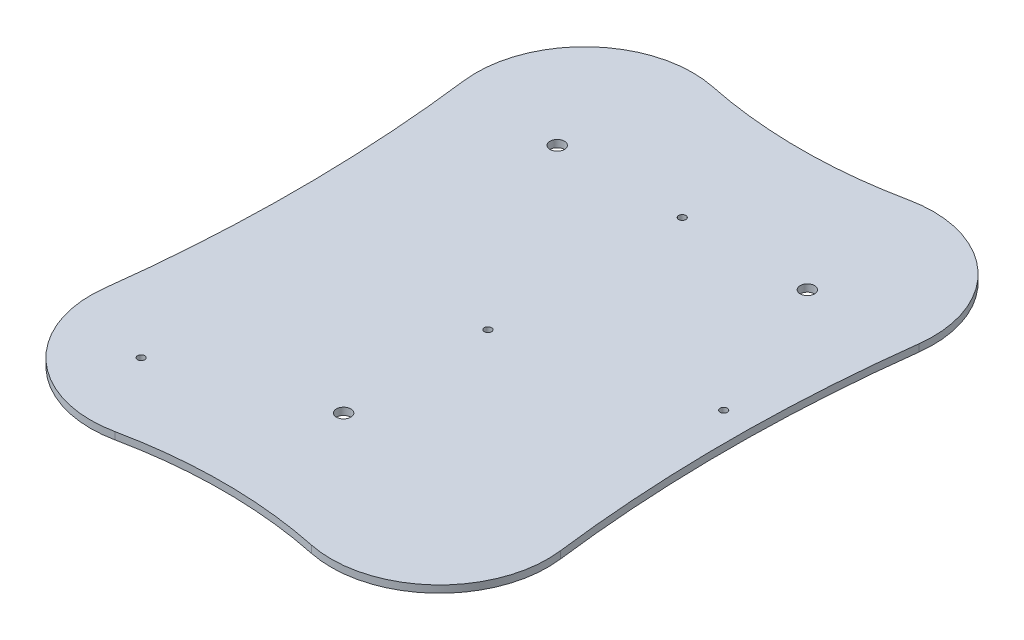
ISO-10303-21;
HEADER;
FILE_DESCRIPTION(('STEP AP214'),'2;1');
FILE_NAME('part.step','',(''),(''),'','','');
FILE_SCHEMA(('AUTOMOTIVE_DESIGN { 1 0 10303 214 1 1 1 1 }'));
ENDSEC;
DATA;
#1=APPLICATION_CONTEXT('core data for automotive mechanical design processes');
#2=APPLICATION_PROTOCOL_DEFINITION('international standard','automotive_design',2000,#1);
#3=PRODUCT_CONTEXT('',#1,'mechanical');
#4=PRODUCT('Part','Part','',(#3));
#5=PRODUCT_RELATED_PRODUCT_CATEGORY('part','',(#4));
#6=PRODUCT_DEFINITION_FORMATION('','',#4);
#7=PRODUCT_DEFINITION_CONTEXT('part definition',#1,'design');
#8=PRODUCT_DEFINITION('design','',#6,#7);
#9=PRODUCT_DEFINITION_SHAPE('','',#8);
#10=(LENGTH_UNIT() NAMED_UNIT(*) SI_UNIT(.MILLI.,.METRE.));
#11=(NAMED_UNIT(*) PLANE_ANGLE_UNIT() SI_UNIT($,.RADIAN.));
#12=(NAMED_UNIT(*) SI_UNIT($,.STERADIAN.) SOLID_ANGLE_UNIT());
#13=UNCERTAINTY_MEASURE_WITH_UNIT(LENGTH_MEASURE(1.E-05),#10,'distance_accuracy_value','');
#14=(GEOMETRIC_REPRESENTATION_CONTEXT(3) GLOBAL_UNCERTAINTY_ASSIGNED_CONTEXT((#13)) GLOBAL_UNIT_ASSIGNED_CONTEXT((#10,
#11,#12)) REPRESENTATION_CONTEXT('',''));
#15=CARTESIAN_POINT('',(0.,0.,0.));
#16=DIRECTION('',(0.,0.,1.));
#17=DIRECTION('',(1.,0.,0.));
#18=AXIS2_PLACEMENT_3D('',#15,#16,#17);
#19=CARTESIAN_POINT('',(-185.000006532533,1.5,25.0390765857744));
#20=DIRECTION('',(0.,-1.,0.));
#21=DIRECTION('',(0.,0.,-1.));
#22=AXIS2_PLACEMENT_3D('',#19,#20,#21);
#23=PLANE('',#22);
#24=CARTESIAN_POINT('',(38.9999999999999,1.5,0.));
#25=DIRECTION('',(0.,1.,0.));
#26=DIRECTION('',(0.,0.,1.));
#27=AXIS2_PLACEMENT_3D('',#24,#25,#26);
#28=CIRCLE('',#27,0.749999999999999);
#29=CARTESIAN_POINT('',(38.9999999999999,1.5,0.749999999999999));
#30=VERTEX_POINT('',#29);
#31=EDGE_CURVE('E214',#30,#30,#28,.T.);
#32=ORIENTED_EDGE('',*,*,#31,.F.);
#33=EDGE_LOOP('',(#32));
#34=FACE_BOUND('',#33,.T.);
#35=CARTESIAN_POINT('',(-31.0104207051516,1.5,51.0885608116344));
#36=DIRECTION('',(0.,1.,0.));
#37=DIRECTION('',(0.,0.,1.));
#38=AXIS2_PLACEMENT_3D('',#35,#36,#37);
#39=CIRCLE('',#38,0.750000000000007);
#40=CARTESIAN_POINT('',(-31.0104207051516,1.5,51.8385608116344));
#41=VERTEX_POINT('',#40);
#42=EDGE_CURVE('E208',#41,#41,#39,.T.);
#43=ORIENTED_EDGE('',*,*,#42,.F.);
#44=EDGE_LOOP('',(#43));
#45=FACE_BOUND('',#44,.T.);
#46=CARTESIAN_POINT('',(0.,1.5,10.));
#47=DIRECTION('',(0.,1.,0.));
#48=DIRECTION('',(0.,0.,1.));
#49=AXIS2_PLACEMENT_3D('',#46,#47,#48);
#50=CIRCLE('',#49,0.75);
#51=CARTESIAN_POINT('',(0.,1.5,10.75));
#52=VERTEX_POINT('',#51);
#53=EDGE_CURVE('E202',#52,#52,#50,.T.);
#54=ORIENTED_EDGE('',*,*,#53,.F.);
#55=EDGE_LOOP('',(#54));
#56=FACE_BOUND('',#55,.T.);
#57=CARTESIAN_POINT('',(0.,1.5,-30.3973683071413));
#58=DIRECTION('',(0.,1.,0.));
#59=DIRECTION('',(0.,0.,1.));
#60=AXIS2_PLACEMENT_3D('',#57,#58,#59);
#61=CIRCLE('',#60,0.75);
#62=CARTESIAN_POINT('',(0.,1.5,-29.6473683071413));
#63=VERTEX_POINT('',#62);
#64=EDGE_CURVE('E196',#63,#63,#61,.T.);
#65=ORIENTED_EDGE('',*,*,#64,.F.);
#66=EDGE_LOOP('',(#65));
#67=FACE_BOUND('',#66,.T.);
#68=CARTESIAN_POINT('',(26.,1.5,-30.3973683071413));
#69=DIRECTION('',(0.,1.,0.));
#70=DIRECTION('',(0.,0.,1.));
#71=AXIS2_PLACEMENT_3D('',#68,#69,#70);
#72=CIRCLE('',#71,1.5);
#73=CARTESIAN_POINT('',(26.,1.5,-28.8973683071413));
#74=VERTEX_POINT('',#73);
#75=EDGE_CURVE('E181',#74,#74,#72,.T.);
#76=ORIENTED_EDGE('',*,*,#75,.F.);
#77=EDGE_LOOP('',(#76));
#78=FACE_BOUND('',#77,.T.);
#79=CARTESIAN_POINT('',(-25.000013065066,1.5,45.0781531715487));
#80=DIRECTION('',(0.,1.,0.));
#81=DIRECTION('',(0.,0.,-1.));
#82=AXIS2_PLACEMENT_3D('',#79,#80,#81);
#83=CIRCLE('',#82,22.5);
#84=CARTESIAN_POINT('',(-47.3255935488986,1.5,42.2820029502779));
#85=VERTEX_POINT('',#84);
#86=CARTESIAN_POINT('',(-20.4081739306661,1.5,67.1046148339173));
#87=VERTEX_POINT('',#86);
#88=EDGE_CURVE('E144',#85,#87,#83,.T.);
#89=ORIENTED_EDGE('',*,*,#88,.T.);
#90=CARTESIAN_POINT('',(0.,1.5,165.));
#91=DIRECTION('',(0.,-1.,0.));
#92=DIRECTION('',(0.,0.,-1.));
#93=AXIS2_PLACEMENT_3D('',#90,#91,#92);
#94=CIRCLE('',#93,100.);
#95=CARTESIAN_POINT('',(20.4081739306661,1.5,67.1046148339173));
#96=VERTEX_POINT('',#95);
#97=EDGE_CURVE('E92',#87,#96,#94,.T.);
#98=ORIENTED_EDGE('',*,*,#97,.T.);
#99=CARTESIAN_POINT('',(25.000013065066,1.5,45.0781531715487));
#100=DIRECTION('',(0.,1.,0.));
#101=DIRECTION('',(0.,0.,1.));
#102=AXIS2_PLACEMENT_3D('',#99,#100,#101);
#103=CIRCLE('',#102,22.5);
#104=CARTESIAN_POINT('',(47.3255935488986,1.5,42.2820029502779));
#105=VERTEX_POINT('',#104);
#106=EDGE_CURVE('E159',#96,#105,#103,.T.);
#107=ORIENTED_EDGE('',*,*,#106,.T.);
#108=CARTESIAN_POINT('',(345.,1.5,5.));
#109=DIRECTION('',(0.,-1.,0.));
#110=DIRECTION('',(0.,0.,1.));
#111=AXIS2_PLACEMENT_3D('',#108,#109,#110);
#112=CIRCLE('',#111,300.);
#113=CARTESIAN_POINT('',(47.3255935488986,1.5,-32.2820029502779));
#114=VERTEX_POINT('',#113);
#115=EDGE_CURVE('E172',#105,#114,#112,.T.);
#116=ORIENTED_EDGE('',*,*,#115,.T.);
#117=CARTESIAN_POINT('',(25.000013065066,1.5,-35.0781531715487));
#118=DIRECTION('',(0.,1.,0.));
#119=DIRECTION('',(0.,0.,-1.));
#120=AXIS2_PLACEMENT_3D('',#117,#118,#119);
#121=CIRCLE('',#120,22.5);
#122=CARTESIAN_POINT('',(20.4081739306661,1.5,-57.1046148339173));
#123=VERTEX_POINT('',#122);
#124=EDGE_CURVE('E111',#114,#123,#121,.T.);
#125=ORIENTED_EDGE('',*,*,#124,.T.);
#126=CARTESIAN_POINT('',(0.,1.5,-155.));
#127=DIRECTION('',(0.,-1.,0.));
#128=DIRECTION('',(0.,0.,1.));
#129=AXIS2_PLACEMENT_3D('',#126,#127,#128);
#130=CIRCLE('',#129,100.);
#131=CARTESIAN_POINT('',(-20.4081739306661,1.5,-57.1046148339173));
#132=VERTEX_POINT('',#131);
#133=EDGE_CURVE('E105',#123,#132,#130,.T.);
#134=ORIENTED_EDGE('',*,*,#133,.T.);
#135=CARTESIAN_POINT('',(-25.000013065066,1.5,-35.0781531715487));
#136=DIRECTION('',(0.,1.,0.));
#137=DIRECTION('',(0.,0.,1.));
#138=AXIS2_PLACEMENT_3D('',#135,#136,#137);
#139=CIRCLE('',#138,22.5);
#140=CARTESIAN_POINT('',(-47.3255935488986,1.5,-32.2820029502779));
#141=VERTEX_POINT('',#140);
#142=EDGE_CURVE('E109',#132,#141,#139,.T.);
#143=ORIENTED_EDGE('',*,*,#142,.T.);
#144=CARTESIAN_POINT('',(-345.,1.5,5.));
#145=DIRECTION('',(0.,-1.,0.));
#146=DIRECTION('',(0.,0.,-1.));
#147=AXIS2_PLACEMENT_3D('',#144,#145,#146);
#148=CIRCLE('',#147,300.);
#149=EDGE_CURVE('E49',#141,#85,#148,.T.);
#150=ORIENTED_EDGE('',*,*,#149,.T.);
#151=EDGE_LOOP('',(#89,#98,#107,#116,#125,#134,#143,#150));
#152=FACE_BOUND('',#151,.T.);
#153=CARTESIAN_POINT('',(-26.,1.5,-30.3973683071413));
#154=DIRECTION('',(0.,1.,0.));
#155=DIRECTION('',(0.,0.,1.));
#156=AXIS2_PLACEMENT_3D('',#153,#154,#155);
#157=CIRCLE('',#156,1.5);
#158=CARTESIAN_POINT('',(-26.,1.5,-28.8973683071413));
#159=VERTEX_POINT('',#158);
#160=EDGE_CURVE('E133',#159,#159,#157,.T.);
#161=ORIENTED_EDGE('',*,*,#160,.F.);
#162=EDGE_LOOP('',(#161));
#163=FACE_BOUND('',#162,.T.);
#164=CARTESIAN_POINT('',(0.,1.5,40.));
#165=DIRECTION('',(0.,1.,0.));
#166=DIRECTION('',(0.,0.,1.));
#167=AXIS2_PLACEMENT_3D('',#164,#165,#166);
#168=CIRCLE('',#167,1.5);
#169=CARTESIAN_POINT('',(0.,1.5,41.5));
#170=VERTEX_POINT('',#169);
#171=EDGE_CURVE('E187',#170,#170,#168,.T.);
#172=ORIENTED_EDGE('',*,*,#171,.F.);
#173=EDGE_LOOP('',(#172));
#174=FACE_BOUND('',#173,.T.);
#175=ADVANCED_FACE('F32',(#34,#45,#56,#67,#78,#152,#163,#174),#23,.F.);
#176=CARTESIAN_POINT('',(-185.000006532533,0.,25.0390765857744));
#177=DIRECTION('',(0.,-1.,0.));
#178=DIRECTION('',(0.,0.,-1.));
#179=AXIS2_PLACEMENT_3D('',#176,#177,#178);
#180=PLANE('',#179);
#181=CARTESIAN_POINT('',(38.9999999999999,0.,0.));
#182=DIRECTION('',(0.,1.,0.));
#183=DIRECTION('',(0.,0.,1.));
#184=AXIS2_PLACEMENT_3D('',#181,#182,#183);
#185=CIRCLE('',#184,0.749999999999999);
#186=CARTESIAN_POINT('',(38.9999999999999,0.,0.749999999999999));
#187=VERTEX_POINT('',#186);
#188=EDGE_CURVE('E211',#187,#187,#185,.T.);
#189=ORIENTED_EDGE('',*,*,#188,.T.);
#190=EDGE_LOOP('',(#189));
#191=FACE_BOUND('',#190,.T.);
#192=CARTESIAN_POINT('',(-31.0104207051516,0.,51.0885608116344));
#193=DIRECTION('',(0.,1.,0.));
#194=DIRECTION('',(0.,0.,1.));
#195=AXIS2_PLACEMENT_3D('',#192,#193,#194);
#196=CIRCLE('',#195,0.750000000000007);
#197=CARTESIAN_POINT('',(-31.0104207051516,0.,51.8385608116344));
#198=VERTEX_POINT('',#197);
#199=EDGE_CURVE('E205',#198,#198,#196,.T.);
#200=ORIENTED_EDGE('',*,*,#199,.T.);
#201=EDGE_LOOP('',(#200));
#202=FACE_BOUND('',#201,.T.);
#203=CARTESIAN_POINT('',(0.,0.,10.));
#204=DIRECTION('',(0.,1.,0.));
#205=DIRECTION('',(0.,0.,1.));
#206=AXIS2_PLACEMENT_3D('',#203,#204,#205);
#207=CIRCLE('',#206,0.75);
#208=CARTESIAN_POINT('',(0.,0.,10.75));
#209=VERTEX_POINT('',#208);
#210=EDGE_CURVE('E199',#209,#209,#207,.T.);
#211=ORIENTED_EDGE('',*,*,#210,.T.);
#212=EDGE_LOOP('',(#211));
#213=FACE_BOUND('',#212,.T.);
#214=CARTESIAN_POINT('',(0.,0.,-30.3973683071413));
#215=DIRECTION('',(0.,1.,0.));
#216=DIRECTION('',(0.,0.,1.));
#217=AXIS2_PLACEMENT_3D('',#214,#215,#216);
#218=CIRCLE('',#217,0.75);
#219=CARTESIAN_POINT('',(0.,0.,-29.6473683071413));
#220=VERTEX_POINT('',#219);
#221=EDGE_CURVE('E193',#220,#220,#218,.T.);
#222=ORIENTED_EDGE('',*,*,#221,.T.);
#223=EDGE_LOOP('',(#222));
#224=FACE_BOUND('',#223,.T.);
#225=CARTESIAN_POINT('',(26.,0.,-30.3973683071413));
#226=DIRECTION('',(0.,1.,0.));
#227=DIRECTION('',(0.,0.,1.));
#228=AXIS2_PLACEMENT_3D('',#225,#226,#227);
#229=CIRCLE('',#228,1.5);
#230=CARTESIAN_POINT('',(26.,0.,-28.8973683071413));
#231=VERTEX_POINT('',#230);
#232=EDGE_CURVE('E184',#231,#231,#229,.T.);
#233=ORIENTED_EDGE('',*,*,#232,.T.);
#234=EDGE_LOOP('',(#233));
#235=FACE_BOUND('',#234,.T.);
#236=CARTESIAN_POINT('',(-25.000013065066,0.,45.0781531715487));
#237=DIRECTION('',(0.,1.,0.));
#238=DIRECTION('',(0.,0.,-1.));
#239=AXIS2_PLACEMENT_3D('',#236,#237,#238);
#240=CIRCLE('',#239,22.5);
#241=CARTESIAN_POINT('',(-47.3255935488986,0.,42.2820029502779));
#242=VERTEX_POINT('',#241);
#243=CARTESIAN_POINT('',(-20.4081739306661,0.,67.1046148339173));
#244=VERTEX_POINT('',#243);
#245=EDGE_CURVE('E129',#242,#244,#240,.T.);
#246=ORIENTED_EDGE('',*,*,#245,.F.);
#247=CARTESIAN_POINT('',(-345.,0.,5.));
#248=DIRECTION('',(0.,-1.,0.));
#249=DIRECTION('',(0.,0.,-1.));
#250=AXIS2_PLACEMENT_3D('',#247,#248,#249);
#251=CIRCLE('',#250,300.);
#252=CARTESIAN_POINT('',(-47.3255935488986,0.,-32.2820029502779));
#253=VERTEX_POINT('',#252);
#254=EDGE_CURVE('E84',#253,#242,#251,.T.);
#255=ORIENTED_EDGE('',*,*,#254,.F.);
#256=CARTESIAN_POINT('',(-25.000013065066,0.,-35.0781531715487));
#257=DIRECTION('',(0.,1.,0.));
#258=DIRECTION('',(0.,0.,1.));
#259=AXIS2_PLACEMENT_3D('',#256,#257,#258);
#260=CIRCLE('',#259,22.5);
#261=CARTESIAN_POINT('',(-20.4081739306661,0.,-57.1046148339173));
#262=VERTEX_POINT('',#261);
#263=EDGE_CURVE('E78',#262,#253,#260,.T.);
#264=ORIENTED_EDGE('',*,*,#263,.F.);
#265=CARTESIAN_POINT('',(0.,0.,-155.));
#266=DIRECTION('',(0.,-1.,0.));
#267=DIRECTION('',(0.,0.,1.));
#268=AXIS2_PLACEMENT_3D('',#265,#266,#267);
#269=CIRCLE('',#268,100.);
#270=CARTESIAN_POINT('',(20.4081739306661,0.,-57.1046148339173));
#271=VERTEX_POINT('',#270);
#272=EDGE_CURVE('E119',#271,#262,#269,.T.);
#273=ORIENTED_EDGE('',*,*,#272,.F.);
#274=CARTESIAN_POINT('',(25.000013065066,0.,-35.0781531715487));
#275=DIRECTION('',(0.,1.,0.));
#276=DIRECTION('',(0.,0.,-1.));
#277=AXIS2_PLACEMENT_3D('',#274,#275,#276);
#278=CIRCLE('',#277,22.5);
#279=CARTESIAN_POINT('',(47.3255935488986,0.,-32.2820029502779));
#280=VERTEX_POINT('',#279);
#281=EDGE_CURVE('E139',#280,#271,#278,.T.);
#282=ORIENTED_EDGE('',*,*,#281,.F.);
#283=CARTESIAN_POINT('',(345.,0.,5.));
#284=DIRECTION('',(0.,-1.,0.));
#285=DIRECTION('',(0.,0.,1.));
#286=AXIS2_PLACEMENT_3D('',#283,#284,#285);
#287=CIRCLE('',#286,300.);
#288=CARTESIAN_POINT('',(47.3255935488986,0.,42.2820029502779));
#289=VERTEX_POINT('',#288);
#290=EDGE_CURVE('E137',#289,#280,#287,.T.);
#291=ORIENTED_EDGE('',*,*,#290,.F.);
#292=CARTESIAN_POINT('',(25.000013065066,0.,45.0781531715487));
#293=DIRECTION('',(0.,1.,0.));
#294=DIRECTION('',(0.,0.,1.));
#295=AXIS2_PLACEMENT_3D('',#292,#293,#294);
#296=CIRCLE('',#295,22.5);
#297=CARTESIAN_POINT('',(20.4081739306661,0.,67.1046148339173));
#298=VERTEX_POINT('',#297);
#299=EDGE_CURVE('E135',#298,#289,#296,.T.);
#300=ORIENTED_EDGE('',*,*,#299,.F.);
#301=CARTESIAN_POINT('',(0.,0.,165.));
#302=DIRECTION('',(0.,-1.,0.));
#303=DIRECTION('',(0.,0.,-1.));
#304=AXIS2_PLACEMENT_3D('',#301,#302,#303);
#305=CIRCLE('',#304,100.);
#306=EDGE_CURVE('E132',#244,#298,#305,.T.);
#307=ORIENTED_EDGE('',*,*,#306,.F.);
#308=EDGE_LOOP('',(#246,#255,#264,#273,#282,#291,#300,#307));
#309=FACE_BOUND('',#308,.T.);
#310=CARTESIAN_POINT('',(-26.,0.,-30.3973683071413));
#311=DIRECTION('',(0.,1.,0.));
#312=DIRECTION('',(0.,0.,1.));
#313=AXIS2_PLACEMENT_3D('',#310,#311,#312);
#314=CIRCLE('',#313,1.5);
#315=CARTESIAN_POINT('',(-26.,0.,-28.8973683071413));
#316=VERTEX_POINT('',#315);
#317=EDGE_CURVE('E178',#316,#316,#314,.T.);
#318=ORIENTED_EDGE('',*,*,#317,.T.);
#319=EDGE_LOOP('',(#318));
#320=FACE_BOUND('',#319,.T.);
#321=CARTESIAN_POINT('',(0.,0.,40.));
#322=DIRECTION('',(0.,1.,0.));
#323=DIRECTION('',(0.,0.,1.));
#324=AXIS2_PLACEMENT_3D('',#321,#322,#323);
#325=CIRCLE('',#324,1.5);
#326=CARTESIAN_POINT('',(0.,0.,41.5));
#327=VERTEX_POINT('',#326);
#328=EDGE_CURVE('E190',#327,#327,#325,.T.);
#329=ORIENTED_EDGE('',*,*,#328,.T.);
#330=EDGE_LOOP('',(#329));
#331=FACE_BOUND('',#330,.T.);
#332=ADVANCED_FACE('F163',(#191,#202,#213,#224,#235,#309,#320,#331),#180,.T.);
#333=CARTESIAN_POINT('',(-25.000013065066,1.5,45.0781531715487));
#334=DIRECTION('',(0.,-1.,0.));
#335=DIRECTION('',(0.,0.,-1.));
#336=AXIS2_PLACEMENT_3D('',#333,#334,#335);
#337=CYLINDRICAL_SURFACE('',#336,22.5);
#338=ORIENTED_EDGE('',*,*,#245,.T.);
#339=DIRECTION('',(0.,-1.,0.));
#340=VECTOR('',#339,1.);
#341=CARTESIAN_POINT('',(-20.4081739306661,1.5,67.1046148339173));
#342=LINE('',#341,#340);
#343=EDGE_CURVE('E11',#87,#244,#342,.T.);
#344=ORIENTED_EDGE('',*,*,#343,.F.);
#345=ORIENTED_EDGE('',*,*,#88,.F.);
#346=DIRECTION('',(0.,-1.,0.));
#347=VECTOR('',#346,1.);
#348=CARTESIAN_POINT('',(-47.3255935488986,1.5,42.2820029502779));
#349=LINE('',#348,#347);
#350=EDGE_CURVE('E125',#85,#242,#349,.T.);
#351=ORIENTED_EDGE('',*,*,#350,.T.);
#352=EDGE_LOOP('',(#338,#344,#345,#351));
#353=FACE_BOUND('',#352,.T.);
#354=ADVANCED_FACE('F34',(#353),#337,.T.);
#355=CARTESIAN_POINT('',(0.,1.5,165.));
#356=DIRECTION('',(0.,-1.,0.));
#357=DIRECTION('',(0.,0.,-1.));
#358=AXIS2_PLACEMENT_3D('',#355,#356,#357);
#359=CYLINDRICAL_SURFACE('',#358,100.);
#360=ORIENTED_EDGE('',*,*,#306,.T.);
#361=DIRECTION('',(0.,-1.,0.));
#362=VECTOR('',#361,1.);
#363=CARTESIAN_POINT('',(20.4081739306661,1.5,67.1046148339173));
#364=LINE('',#363,#362);
#365=EDGE_CURVE('E41',#96,#298,#364,.T.);
#366=ORIENTED_EDGE('',*,*,#365,.F.);
#367=ORIENTED_EDGE('',*,*,#97,.F.);
#368=ORIENTED_EDGE('',*,*,#343,.T.);
#369=EDGE_LOOP('',(#360,#366,#367,#368));
#370=FACE_BOUND('',#369,.T.);
#371=ADVANCED_FACE('F253',(#370),#359,.F.);
#372=CARTESIAN_POINT('',(25.000013065066,1.5,45.0781531715487));
#373=DIRECTION('',(0.,-1.,0.));
#374=DIRECTION('',(0.,0.,-1.));
#375=AXIS2_PLACEMENT_3D('',#372,#373,#374);
#376=CYLINDRICAL_SURFACE('',#375,22.5);
#377=ORIENTED_EDGE('',*,*,#299,.T.);
#378=DIRECTION('',(0.,-1.,0.));
#379=VECTOR('',#378,1.);
#380=CARTESIAN_POINT('',(47.3255935488986,1.5,42.2820029502779));
#381=LINE('',#380,#379);
#382=EDGE_CURVE('E151',#105,#289,#381,.T.);
#383=ORIENTED_EDGE('',*,*,#382,.F.);
#384=ORIENTED_EDGE('',*,*,#106,.F.);
#385=ORIENTED_EDGE('',*,*,#365,.T.);
#386=EDGE_LOOP('',(#377,#383,#384,#385));
#387=FACE_BOUND('',#386,.T.);
#388=ADVANCED_FACE('F157',(#387),#376,.T.);
#389=CARTESIAN_POINT('',(345.,1.5,5.));
#390=DIRECTION('',(0.,-1.,0.));
#391=DIRECTION('',(0.,0.,-1.));
#392=AXIS2_PLACEMENT_3D('',#389,#390,#391);
#393=CYLINDRICAL_SURFACE('',#392,300.);
#394=ORIENTED_EDGE('',*,*,#290,.T.);
#395=DIRECTION('',(0.,-1.,0.));
#396=VECTOR('',#395,1.);
#397=CARTESIAN_POINT('',(47.3255935488986,1.5,-32.2820029502779));
#398=LINE('',#397,#396);
#399=EDGE_CURVE('E148',#114,#280,#398,.T.);
#400=ORIENTED_EDGE('',*,*,#399,.F.);
#401=ORIENTED_EDGE('',*,*,#115,.F.);
#402=ORIENTED_EDGE('',*,*,#382,.T.);
#403=EDGE_LOOP('',(#394,#400,#401,#402));
#404=FACE_BOUND('',#403,.T.);
#405=ADVANCED_FACE('F168',(#404),#393,.F.);
#406=CARTESIAN_POINT('',(25.000013065066,1.5,-35.0781531715487));
#407=DIRECTION('',(0.,-1.,0.));
#408=DIRECTION('',(0.,0.,-1.));
#409=AXIS2_PLACEMENT_3D('',#406,#407,#408);
#410=CYLINDRICAL_SURFACE('',#409,22.5);
#411=ORIENTED_EDGE('',*,*,#281,.T.);
#412=DIRECTION('',(0.,-1.,0.));
#413=VECTOR('',#412,1.);
#414=CARTESIAN_POINT('',(20.4081739306661,1.5,-57.1046148339173));
#415=LINE('',#414,#413);
#416=EDGE_CURVE('E120',#123,#271,#415,.T.);
#417=ORIENTED_EDGE('',*,*,#416,.F.);
#418=ORIENTED_EDGE('',*,*,#124,.F.);
#419=ORIENTED_EDGE('',*,*,#399,.T.);
#420=EDGE_LOOP('',(#411,#417,#418,#419));
#421=FACE_BOUND('',#420,.T.);
#422=ADVANCED_FACE('F171',(#421),#410,.T.);
#423=CARTESIAN_POINT('',(0.,1.5,-155.));
#424=DIRECTION('',(0.,-1.,0.));
#425=DIRECTION('',(0.,0.,-1.));
#426=AXIS2_PLACEMENT_3D('',#423,#424,#425);
#427=CYLINDRICAL_SURFACE('',#426,100.);
#428=ORIENTED_EDGE('',*,*,#272,.T.);
#429=DIRECTION('',(0.,-1.,0.));
#430=VECTOR('',#429,1.);
#431=CARTESIAN_POINT('',(-20.4081739306661,1.5,-57.1046148339173));
#432=LINE('',#431,#430);
#433=EDGE_CURVE('E116',#132,#262,#432,.T.);
#434=ORIENTED_EDGE('',*,*,#433,.F.);
#435=ORIENTED_EDGE('',*,*,#133,.F.);
#436=ORIENTED_EDGE('',*,*,#416,.T.);
#437=EDGE_LOOP('',(#428,#434,#435,#436));
#438=FACE_BOUND('',#437,.T.);
#439=ADVANCED_FACE('F117',(#438),#427,.F.);
#440=CARTESIAN_POINT('',(-25.000013065066,1.5,-35.0781531715487));
#441=DIRECTION('',(0.,-1.,0.));
#442=DIRECTION('',(0.,0.,-1.));
#443=AXIS2_PLACEMENT_3D('',#440,#441,#442);
#444=CYLINDRICAL_SURFACE('',#443,22.5);
#445=ORIENTED_EDGE('',*,*,#263,.T.);
#446=DIRECTION('',(0.,-1.,0.));
#447=VECTOR('',#446,1.);
#448=CARTESIAN_POINT('',(-47.3255935488986,1.5,-32.2820029502779));
#449=LINE('',#448,#447);
#450=EDGE_CURVE('E121',#141,#253,#449,.T.);
#451=ORIENTED_EDGE('',*,*,#450,.F.);
#452=ORIENTED_EDGE('',*,*,#142,.F.);
#453=ORIENTED_EDGE('',*,*,#433,.T.);
#454=EDGE_LOOP('',(#445,#451,#452,#453));
#455=FACE_BOUND('',#454,.T.);
#456=ADVANCED_FACE('F123',(#455),#444,.T.);
#457=CARTESIAN_POINT('',(-345.,1.5,5.));
#458=DIRECTION('',(0.,-1.,0.));
#459=DIRECTION('',(0.,0.,-1.));
#460=AXIS2_PLACEMENT_3D('',#457,#458,#459);
#461=CYLINDRICAL_SURFACE('',#460,300.);
#462=ORIENTED_EDGE('',*,*,#254,.T.);
#463=ORIENTED_EDGE('',*,*,#350,.F.);
#464=ORIENTED_EDGE('',*,*,#149,.F.);
#465=ORIENTED_EDGE('',*,*,#450,.T.);
#466=EDGE_LOOP('',(#462,#463,#464,#465));
#467=FACE_BOUND('',#466,.T.);
#468=ADVANCED_FACE('F257',(#467),#461,.F.);
#469=CARTESIAN_POINT('',(-26.,1.5,-30.3973683071413));
#470=DIRECTION('',(0.,-1.,0.));
#471=DIRECTION('',(0.,0.,-1.));
#472=AXIS2_PLACEMENT_3D('',#469,#470,#471);
#473=CYLINDRICAL_SURFACE('',#472,1.5);
#474=ORIENTED_EDGE('',*,*,#160,.T.);
#475=EDGE_LOOP('',(#474));
#476=FACE_BOUND('',#475,.T.);
#477=ORIENTED_EDGE('',*,*,#317,.F.);
#478=EDGE_LOOP('',(#477));
#479=FACE_BOUND('',#478,.T.);
#480=ADVANCED_FACE('F244',(#476,#479),#473,.F.);
#481=CARTESIAN_POINT('',(26.,1.5,-30.3973683071413));
#482=DIRECTION('',(0.,-1.,0.));
#483=DIRECTION('',(0.,0.,-1.));
#484=AXIS2_PLACEMENT_3D('',#481,#482,#483);
#485=CYLINDRICAL_SURFACE('',#484,1.5);
#486=ORIENTED_EDGE('',*,*,#75,.T.);
#487=EDGE_LOOP('',(#486));
#488=FACE_BOUND('',#487,.T.);
#489=ORIENTED_EDGE('',*,*,#232,.F.);
#490=EDGE_LOOP('',(#489));
#491=FACE_BOUND('',#490,.T.);
#492=ADVANCED_FACE('F240',(#488,#491),#485,.F.);
#493=CARTESIAN_POINT('',(0.,1.5,40.));
#494=DIRECTION('',(0.,-1.,0.));
#495=DIRECTION('',(0.,0.,-1.));
#496=AXIS2_PLACEMENT_3D('',#493,#494,#495);
#497=CYLINDRICAL_SURFACE('',#496,1.5);
#498=ORIENTED_EDGE('',*,*,#171,.T.);
#499=EDGE_LOOP('',(#498));
#500=FACE_BOUND('',#499,.T.);
#501=ORIENTED_EDGE('',*,*,#328,.F.);
#502=EDGE_LOOP('',(#501));
#503=FACE_BOUND('',#502,.T.);
#504=ADVANCED_FACE('F243',(#500,#503),#497,.F.);
#505=CARTESIAN_POINT('',(0.,0.,-30.3973683071413));
#506=DIRECTION('',(0.,1.,0.));
#507=DIRECTION('',(0.,0.,1.));
#508=AXIS2_PLACEMENT_3D('',#505,#506,#507);
#509=CYLINDRICAL_SURFACE('',#508,0.75);
#510=ORIENTED_EDGE('',*,*,#221,.F.);
#511=EDGE_LOOP('',(#510));
#512=FACE_BOUND('',#511,.T.);
#513=ORIENTED_EDGE('',*,*,#64,.T.);
#514=EDGE_LOOP('',(#513));
#515=FACE_BOUND('',#514,.T.);
#516=ADVANCED_FACE('F316',(#512,#515),#509,.F.);
#517=CARTESIAN_POINT('',(0.,0.,10.));
#518=DIRECTION('',(0.,1.,0.));
#519=DIRECTION('',(0.,0.,1.));
#520=AXIS2_PLACEMENT_3D('',#517,#518,#519);
#521=CYLINDRICAL_SURFACE('',#520,0.75);
#522=ORIENTED_EDGE('',*,*,#210,.F.);
#523=EDGE_LOOP('',(#522));
#524=FACE_BOUND('',#523,.T.);
#525=ORIENTED_EDGE('',*,*,#53,.T.);
#526=EDGE_LOOP('',(#525));
#527=FACE_BOUND('',#526,.T.);
#528=ADVANCED_FACE('F325',(#524,#527),#521,.F.);
#529=CARTESIAN_POINT('',(-31.0104207051516,0.,51.0885608116344));
#530=DIRECTION('',(0.,1.,0.));
#531=DIRECTION('',(0.,0.,1.));
#532=AXIS2_PLACEMENT_3D('',#529,#530,#531);
#533=CYLINDRICAL_SURFACE('',#532,0.750000000000007);
#534=ORIENTED_EDGE('',*,*,#199,.F.);
#535=EDGE_LOOP('',(#534));
#536=FACE_BOUND('',#535,.T.);
#537=ORIENTED_EDGE('',*,*,#42,.T.);
#538=EDGE_LOOP('',(#537));
#539=FACE_BOUND('',#538,.T.);
#540=ADVANCED_FACE('F225',(#536,#539),#533,.F.);
#541=CARTESIAN_POINT('',(38.9999999999999,0.,0.));
#542=DIRECTION('',(0.,1.,0.));
#543=DIRECTION('',(0.,0.,1.));
#544=AXIS2_PLACEMENT_3D('',#541,#542,#543);
#545=CYLINDRICAL_SURFACE('',#544,0.749999999999999);
#546=ORIENTED_EDGE('',*,*,#188,.F.);
#547=EDGE_LOOP('',(#546));
#548=FACE_BOUND('',#547,.T.);
#549=ORIENTED_EDGE('',*,*,#31,.T.);
#550=EDGE_LOOP('',(#549));
#551=FACE_BOUND('',#550,.T.);
#552=ADVANCED_FACE('F222',(#548,#551),#545,.F.);
#553=CLOSED_SHELL('',(#175,#332,#354,#371,#388,#405,#422,#439,#456,#468,#480,#492,#504,#516,
#528,#540,#552));
#554=MANIFOLD_SOLID_BREP('B2',#553);
#555=ADVANCED_BREP_SHAPE_REPRESENTATION('',(#18,#554),#14);
#556=SHAPE_DEFINITION_REPRESENTATION(#9,#555);
ENDSEC;
END-ISO-10303-21;
